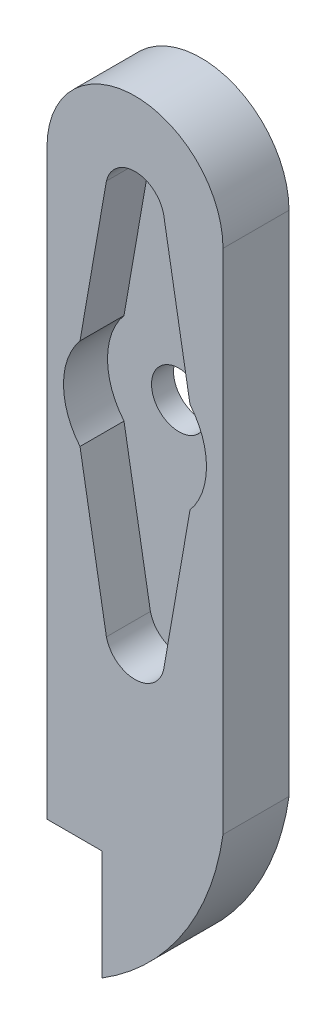
ISO-10303-21;
HEADER;
FILE_DESCRIPTION(('STEP AP214'),'2;1');
FILE_NAME('part.step','',(''),(''),'','','');
FILE_SCHEMA(('AUTOMOTIVE_DESIGN { 1 0 10303 214 1 1 1 1 }'));
ENDSEC;
DATA;
#1=APPLICATION_CONTEXT('core data for automotive mechanical design processes');
#2=APPLICATION_PROTOCOL_DEFINITION('international standard','automotive_design',2000,#1);
#3=PRODUCT_CONTEXT('',#1,'mechanical');
#4=PRODUCT('Part','Part','',(#3));
#5=PRODUCT_RELATED_PRODUCT_CATEGORY('part','',(#4));
#6=PRODUCT_DEFINITION_FORMATION('','',#4);
#7=PRODUCT_DEFINITION_CONTEXT('part definition',#1,'design');
#8=PRODUCT_DEFINITION('design','',#6,#7);
#9=PRODUCT_DEFINITION_SHAPE('','',#8);
#10=(LENGTH_UNIT() NAMED_UNIT(*) SI_UNIT(.MILLI.,.METRE.));
#11=(NAMED_UNIT(*) PLANE_ANGLE_UNIT() SI_UNIT($,.RADIAN.));
#12=(NAMED_UNIT(*) SI_UNIT($,.STERADIAN.) SOLID_ANGLE_UNIT());
#13=UNCERTAINTY_MEASURE_WITH_UNIT(LENGTH_MEASURE(1.E-05),#10,'distance_accuracy_value','');
#14=(GEOMETRIC_REPRESENTATION_CONTEXT(3) GLOBAL_UNCERTAINTY_ASSIGNED_CONTEXT((#13)) GLOBAL_UNIT_ASSIGNED_CONTEXT((#10,
#11,#12)) REPRESENTATION_CONTEXT('',''));
#15=CARTESIAN_POINT('',(0.,0.,0.));
#16=DIRECTION('',(0.,0.,1.));
#17=DIRECTION('',(1.,0.,0.));
#18=AXIS2_PLACEMENT_3D('',#15,#16,#17);
#19=CARTESIAN_POINT('',(-15.4438194612036,-24.8497426398111,6.));
#20=DIRECTION('',(0.,0.,-1.));
#21=DIRECTION('',(-1.,0.,0.));
#22=AXIS2_PLACEMENT_3D('',#19,#20,#21);
#23=CYLINDRICAL_SURFACE('',#22,23.6829372009655);
#24=CARTESIAN_POINT('',(-15.4438194612036,-24.8497426398111,0.));
#25=DIRECTION('',(0.,0.,1.));
#26=DIRECTION('',(1.,0.,0.));
#27=AXIS2_PLACEMENT_3D('',#24,#25,#26);
#28=CIRCLE('',#27,23.6829372009655);
#29=CARTESIAN_POINT('',(8.,-28.2066524591789,0.));
#30=VERTEX_POINT('',#29);
#31=CARTESIAN_POINT('',(-3.,-45.,0.));
#32=VERTEX_POINT('',#31);
#33=EDGE_CURVE('E225',#30,#32,#28,.F.);
#34=ORIENTED_EDGE('',*,*,#33,.F.);
#35=DIRECTION('',(0.,0.,-1.));
#36=VECTOR('',#35,1.);
#37=CARTESIAN_POINT('',(8.,-28.2066524591789,6.));
#38=LINE('',#37,#36);
#39=CARTESIAN_POINT('',(8.,-28.2066524591789,6.));
#40=VERTEX_POINT('',#39);
#41=EDGE_CURVE('E50',#40,#30,#38,.T.);
#42=ORIENTED_EDGE('',*,*,#41,.F.);
#43=CARTESIAN_POINT('',(-15.4438194612036,-24.8497426398111,6.));
#44=DIRECTION('',(0.,0.,1.));
#45=DIRECTION('',(1.,0.,0.));
#46=AXIS2_PLACEMENT_3D('',#43,#44,#45);
#47=CIRCLE('',#46,23.6829372009655);
#48=CARTESIAN_POINT('',(-3.,-45.,6.));
#49=VERTEX_POINT('',#48);
#50=EDGE_CURVE('E236',#40,#49,#47,.F.);
#51=ORIENTED_EDGE('',*,*,#50,.T.);
#52=DIRECTION('',(0.,0.,-1.));
#53=VECTOR('',#52,1.);
#54=CARTESIAN_POINT('',(-3.,-45.,6.));
#55=LINE('',#54,#53);
#56=EDGE_CURVE('E92',#49,#32,#55,.T.);
#57=ORIENTED_EDGE('',*,*,#56,.T.);
#58=EDGE_LOOP('',(#34,#42,#51,#57));
#59=FACE_BOUND('',#58,.T.);
#60=ADVANCED_FACE('F41',(#59),#23,.T.);
#61=CARTESIAN_POINT('',(8.,0.,6.));
#62=DIRECTION('',(-1.,0.,0.));
#63=DIRECTION('',(0.,0.,1.));
#64=AXIS2_PLACEMENT_3D('',#61,#62,#63);
#65=PLANE('',#64);
#66=DIRECTION('',(0.,1.,0.));
#67=VECTOR('',#66,1.);
#68=CARTESIAN_POINT('',(8.,0.,0.));
#69=LINE('',#68,#67);
#70=CARTESIAN_POINT('',(8.,17.9427517196533,0.));
#71=VERTEX_POINT('',#70);
#72=EDGE_CURVE('E221',#30,#71,#69,.T.);
#73=ORIENTED_EDGE('',*,*,#72,.T.);
#74=DIRECTION('',(0.,0.,-1.));
#75=VECTOR('',#74,1.);
#76=CARTESIAN_POINT('',(8.,17.9427517196533,6.));
#77=LINE('',#76,#75);
#78=CARTESIAN_POINT('',(8.,17.9427517196533,6.));
#79=VERTEX_POINT('',#78);
#80=EDGE_CURVE('E165',#79,#71,#77,.T.);
#81=ORIENTED_EDGE('',*,*,#80,.F.);
#82=DIRECTION('',(0.,1.,0.));
#83=VECTOR('',#82,1.);
#84=CARTESIAN_POINT('',(8.,0.,6.));
#85=LINE('',#84,#83);
#86=EDGE_CURVE('E233',#40,#79,#85,.T.);
#87=ORIENTED_EDGE('',*,*,#86,.F.);
#88=ORIENTED_EDGE('',*,*,#41,.T.);
#89=EDGE_LOOP('',(#73,#81,#87,#88));
#90=FACE_BOUND('',#89,.T.);
#91=ADVANCED_FACE('F316',(#90),#65,.F.);
#92=CARTESIAN_POINT('',(0.,17.9427517196533,6.));
#93=DIRECTION('',(0.,0.,-1.));
#94=DIRECTION('',(-1.,0.,0.));
#95=AXIS2_PLACEMENT_3D('',#92,#93,#94);
#96=CYLINDRICAL_SURFACE('',#95,8.);
#97=CARTESIAN_POINT('',(0.,17.9427517196533,0.));
#98=DIRECTION('',(0.,0.,1.));
#99=DIRECTION('',(1.,0.,0.));
#100=AXIS2_PLACEMENT_3D('',#97,#98,#99);
#101=CIRCLE('',#100,8.);
#102=CARTESIAN_POINT('',(-8.,17.9427517196533,0.));
#103=VERTEX_POINT('',#102);
#104=EDGE_CURVE('E217',#71,#103,#101,.T.);
#105=ORIENTED_EDGE('',*,*,#104,.T.);
#106=DIRECTION('',(0.,0.,-1.));
#107=VECTOR('',#106,1.);
#108=CARTESIAN_POINT('',(-8.,17.9427517196533,6.));
#109=LINE('',#108,#107);
#110=CARTESIAN_POINT('',(-8.,17.9427517196533,6.));
#111=VERTEX_POINT('',#110);
#112=EDGE_CURVE('E161',#111,#103,#109,.T.);
#113=ORIENTED_EDGE('',*,*,#112,.F.);
#114=CARTESIAN_POINT('',(0.,17.9427517196533,6.));
#115=DIRECTION('',(0.,0.,1.));
#116=DIRECTION('',(1.,0.,0.));
#117=AXIS2_PLACEMENT_3D('',#114,#115,#116);
#118=CIRCLE('',#117,8.);
#119=EDGE_CURVE('E152',#79,#111,#118,.T.);
#120=ORIENTED_EDGE('',*,*,#119,.F.);
#121=ORIENTED_EDGE('',*,*,#80,.T.);
#122=EDGE_LOOP('',(#105,#113,#120,#121));
#123=FACE_BOUND('',#122,.T.);
#124=ADVANCED_FACE('F321',(#123),#96,.T.);
#125=CARTESIAN_POINT('',(-8.,0.,6.));
#126=DIRECTION('',(1.,0.,0.));
#127=DIRECTION('',(0.,0.,-1.));
#128=AXIS2_PLACEMENT_3D('',#125,#126,#127);
#129=PLANE('',#128);
#130=DIRECTION('',(0.,-1.,0.));
#131=VECTOR('',#130,1.);
#132=CARTESIAN_POINT('',(-8.,0.,0.));
#133=LINE('',#132,#131);
#134=CARTESIAN_POINT('',(-8.,-35.,0.));
#135=VERTEX_POINT('',#134);
#136=EDGE_CURVE('E159',#103,#135,#133,.T.);
#137=ORIENTED_EDGE('',*,*,#136,.T.);
#138=DIRECTION('',(0.,0.,-1.));
#139=VECTOR('',#138,1.);
#140=CARTESIAN_POINT('',(-8.,-35.,6.));
#141=LINE('',#140,#139);
#142=CARTESIAN_POINT('',(-8.,-35.,6.));
#143=VERTEX_POINT('',#142);
#144=EDGE_CURVE('E142',#143,#135,#141,.T.);
#145=ORIENTED_EDGE('',*,*,#144,.F.);
#146=DIRECTION('',(0.,-1.,0.));
#147=VECTOR('',#146,1.);
#148=CARTESIAN_POINT('',(-8.,0.,6.));
#149=LINE('',#148,#147);
#150=EDGE_CURVE('E147',#111,#143,#149,.T.);
#151=ORIENTED_EDGE('',*,*,#150,.F.);
#152=ORIENTED_EDGE('',*,*,#112,.T.);
#153=EDGE_LOOP('',(#137,#145,#151,#152));
#154=FACE_BOUND('',#153,.T.);
#155=ADVANCED_FACE('F158',(#154),#129,.F.);
#156=CARTESIAN_POINT('',(0.,-35.,6.));
#157=DIRECTION('',(0.,1.,0.));
#158=DIRECTION('',(0.,0.,1.));
#159=AXIS2_PLACEMENT_3D('',#156,#157,#158);
#160=PLANE('',#159);
#161=DIRECTION('',(1.,0.,0.));
#162=VECTOR('',#161,1.);
#163=CARTESIAN_POINT('',(0.,-35.,0.));
#164=LINE('',#163,#162);
#165=CARTESIAN_POINT('',(-3.,-35.,0.));
#166=VERTEX_POINT('',#165);
#167=EDGE_CURVE('E212',#135,#166,#164,.T.);
#168=ORIENTED_EDGE('',*,*,#167,.T.);
#169=DIRECTION('',(0.,0.,-1.));
#170=VECTOR('',#169,1.);
#171=CARTESIAN_POINT('',(-3.,-35.,6.));
#172=LINE('',#171,#170);
#173=CARTESIAN_POINT('',(-3.,-35.,6.));
#174=VERTEX_POINT('',#173);
#175=EDGE_CURVE('E145',#174,#166,#172,.T.);
#176=ORIENTED_EDGE('',*,*,#175,.F.);
#177=DIRECTION('',(1.,0.,0.));
#178=VECTOR('',#177,1.);
#179=CARTESIAN_POINT('',(0.,-35.,6.));
#180=LINE('',#179,#178);
#181=EDGE_CURVE('E137',#143,#174,#180,.T.);
#182=ORIENTED_EDGE('',*,*,#181,.F.);
#183=ORIENTED_EDGE('',*,*,#144,.T.);
#184=EDGE_LOOP('',(#168,#176,#182,#183));
#185=FACE_BOUND('',#184,.T.);
#186=ADVANCED_FACE('F140',(#185),#160,.F.);
#187=CARTESIAN_POINT('',(0.,17.3284045022662,6.));
#188=DIRECTION('',(0.,0.,-1.));
#189=DIRECTION('',(-1.,0.,0.));
#190=AXIS2_PLACEMENT_3D('',#187,#188,#189);
#191=CYLINDRICAL_SURFACE('',#190,2.67159549773375);
#192=DIRECTION('',(0.,0.,-1.));
#193=VECTOR('',#192,1.);
#194=CARTESIAN_POINT('',(-2.6,17.9427517196533,6.));
#195=LINE('',#194,#193);
#196=CARTESIAN_POINT('',(-2.6,17.9427517196533,6.));
#197=VERTEX_POINT('',#196);
#198=CARTESIAN_POINT('',(-2.6,17.9427517196533,2.));
#199=VERTEX_POINT('',#198);
#200=EDGE_CURVE('E175',#197,#199,#195,.T.);
#201=ORIENTED_EDGE('',*,*,#200,.T.);
#202=CARTESIAN_POINT('',(0.,17.3284045022662,2.));
#203=DIRECTION('',(0.,0.,1.));
#204=DIRECTION('',(1.,0.,0.));
#205=AXIS2_PLACEMENT_3D('',#202,#203,#204);
#206=CIRCLE('',#205,2.67159549773375);
#207=CARTESIAN_POINT('',(2.6,17.9427517196533,2.));
#208=VERTEX_POINT('',#207);
#209=EDGE_CURVE('E57',#199,#208,#206,.F.);
#210=ORIENTED_EDGE('',*,*,#209,.T.);
#211=DIRECTION('',(0.,0.,-1.));
#212=VECTOR('',#211,1.);
#213=CARTESIAN_POINT('',(2.6,17.9427517196533,6.));
#214=LINE('',#213,#212);
#215=CARTESIAN_POINT('',(2.6,17.9427517196533,6.));
#216=VERTEX_POINT('',#215);
#217=EDGE_CURVE('E202',#216,#208,#214,.T.);
#218=ORIENTED_EDGE('',*,*,#217,.F.);
#219=CARTESIAN_POINT('',(0.,17.3284045022662,6.));
#220=DIRECTION('',(0.,0.,1.));
#221=DIRECTION('',(1.,0.,0.));
#222=AXIS2_PLACEMENT_3D('',#219,#220,#221);
#223=CIRCLE('',#222,2.67159549773375);
#224=EDGE_CURVE('E211',#197,#216,#223,.F.);
#225=ORIENTED_EDGE('',*,*,#224,.F.);
#226=EDGE_LOOP('',(#201,#210,#218,#225));
#227=FACE_BOUND('',#226,.T.);
#228=ADVANCED_FACE('F43',(#227),#191,.F.);
#229=CARTESIAN_POINT('',(5.55395819963136,0.96641337059102,6.));
#230=DIRECTION('',(0.985196551403809,0.171428571428571,0.));
#231=DIRECTION('',(-0.171428571428571,0.98519655140381,0.));
#232=AXIS2_PLACEMENT_3D('',#229,#230,#231);
#233=PLANE('',#232);
#234=ORIENTED_EDGE('',*,*,#217,.T.);
#235=DIRECTION('',(0.171428571428571,-0.98519655140381,0.));
#236=VECTOR('',#235,1.);
#237=CARTESIAN_POINT('',(5.55395819963136,0.96641337059102,2.));
#238=LINE('',#237,#236);
#239=CARTESIAN_POINT('',(4.99927103536296,4.15418934510465,2.));
#240=VERTEX_POINT('',#239);
#241=EDGE_CURVE('E268',#208,#240,#238,.T.);
#242=ORIENTED_EDGE('',*,*,#241,.T.);
#243=DIRECTION('',(0.,0.,-1.));
#244=VECTOR('',#243,1.);
#245=CARTESIAN_POINT('',(4.99927103536296,4.15418934510465,6.));
#246=LINE('',#245,#244);
#247=CARTESIAN_POINT('',(4.99927103536296,4.15418934510465,6.));
#248=VERTEX_POINT('',#247);
#249=EDGE_CURVE('E199',#248,#240,#246,.T.);
#250=ORIENTED_EDGE('',*,*,#249,.F.);
#251=DIRECTION('',(0.171428571428571,-0.98519655140381,0.));
#252=VECTOR('',#251,1.);
#253=CARTESIAN_POINT('',(5.55395819963136,0.96641337059102,6.));
#254=LINE('',#253,#252);
#255=EDGE_CURVE('E101',#216,#248,#254,.T.);
#256=ORIENTED_EDGE('',*,*,#255,.F.);
#257=EDGE_LOOP('',(#234,#242,#250,#256));
#258=FACE_BOUND('',#257,.T.);
#259=ADVANCED_FACE('F349',(#258),#233,.F.);
#260=CARTESIAN_POINT('',(0.,0.,6.));
#261=DIRECTION('',(0.,0.,-1.));
#262=DIRECTION('',(-1.,0.,0.));
#263=AXIS2_PLACEMENT_3D('',#260,#261,#262);
#264=CYLINDRICAL_SURFACE('',#263,6.5);
#265=CARTESIAN_POINT('',(0.,0.,2.));
#266=DIRECTION('',(0.,0.,1.));
#267=DIRECTION('',(1.,0.,0.));
#268=AXIS2_PLACEMENT_3D('',#265,#266,#267);
#269=CIRCLE('',#268,6.5);
#270=CARTESIAN_POINT('',(4.99927103536296,-4.15418934510465,2.));
#271=VERTEX_POINT('',#270);
#272=EDGE_CURVE('E271',#271,#240,#269,.T.);
#273=ORIENTED_EDGE('',*,*,#272,.F.);
#274=DIRECTION('',(0.,0.,-1.));
#275=VECTOR('',#274,1.);
#276=CARTESIAN_POINT('',(4.99927103536296,-4.15418934510465,6.));
#277=LINE('',#276,#275);
#278=CARTESIAN_POINT('',(4.99927103536296,-4.15418934510465,6.));
#279=VERTEX_POINT('',#278);
#280=EDGE_CURVE('E195',#279,#271,#277,.T.);
#281=ORIENTED_EDGE('',*,*,#280,.F.);
#282=CARTESIAN_POINT('',(0.,0.,6.));
#283=DIRECTION('',(0.,0.,1.));
#284=DIRECTION('',(1.,0.,0.));
#285=AXIS2_PLACEMENT_3D('',#282,#283,#284);
#286=CIRCLE('',#285,6.5);
#287=EDGE_CURVE('E258',#279,#248,#286,.T.);
#288=ORIENTED_EDGE('',*,*,#287,.T.);
#289=ORIENTED_EDGE('',*,*,#249,.T.);
#290=EDGE_LOOP('',(#273,#281,#288,#289));
#291=FACE_BOUND('',#290,.T.);
#292=ADVANCED_FACE('F346',(#291),#264,.F.);
#293=CARTESIAN_POINT('',(5.55395819963136,-0.96641337059102,6.));
#294=DIRECTION('',(-0.985196551403809,0.171428571428571,0.));
#295=DIRECTION('',(-0.171428571428571,-0.98519655140381,0.));
#296=AXIS2_PLACEMENT_3D('',#293,#294,#295);
#297=PLANE('',#296);
#298=DIRECTION('',(0.171428571428571,0.98519655140381,0.));
#299=VECTOR('',#298,1.);
#300=CARTESIAN_POINT('',(5.55395819963136,-0.96641337059102,2.));
#301=LINE('',#300,#299);
#302=CARTESIAN_POINT('',(2.6,-17.9427517196533,2.));
#303=VERTEX_POINT('',#302);
#304=EDGE_CURVE('E275',#303,#271,#301,.T.);
#305=ORIENTED_EDGE('',*,*,#304,.F.);
#306=DIRECTION('',(0.,0.,-1.));
#307=VECTOR('',#306,1.);
#308=CARTESIAN_POINT('',(2.6,-17.9427517196533,6.));
#309=LINE('',#308,#307);
#310=CARTESIAN_POINT('',(2.6,-17.9427517196533,6.));
#311=VERTEX_POINT('',#310);
#312=EDGE_CURVE('E191',#311,#303,#309,.T.);
#313=ORIENTED_EDGE('',*,*,#312,.F.);
#314=DIRECTION('',(0.171428571428571,0.98519655140381,0.));
#315=VECTOR('',#314,1.);
#316=CARTESIAN_POINT('',(5.55395819963136,-0.96641337059102,6.));
#317=LINE('',#316,#315);
#318=EDGE_CURVE('E254',#311,#279,#317,.T.);
#319=ORIENTED_EDGE('',*,*,#318,.T.);
#320=ORIENTED_EDGE('',*,*,#280,.T.);
#321=EDGE_LOOP('',(#305,#313,#319,#320));
#322=FACE_BOUND('',#321,.T.);
#323=ADVANCED_FACE('F342',(#322),#297,.T.);
#324=CARTESIAN_POINT('',(0.,-17.3284045022662,6.));
#325=DIRECTION('',(0.,0.,-1.));
#326=DIRECTION('',(-1.,0.,0.));
#327=AXIS2_PLACEMENT_3D('',#324,#325,#326);
#328=CYLINDRICAL_SURFACE('',#327,2.67159549773375);
#329=CARTESIAN_POINT('',(0.,-17.3284045022662,2.));
#330=DIRECTION('',(0.,0.,1.));
#331=DIRECTION('',(1.,0.,0.));
#332=AXIS2_PLACEMENT_3D('',#329,#330,#331);
#333=CIRCLE('',#332,2.67159549773375);
#334=CARTESIAN_POINT('',(-2.6,-17.9427517196533,2.));
#335=VERTEX_POINT('',#334);
#336=EDGE_CURVE('E279',#335,#303,#333,.T.);
#337=ORIENTED_EDGE('',*,*,#336,.F.);
#338=DIRECTION('',(0.,0.,-1.));
#339=VECTOR('',#338,1.);
#340=CARTESIAN_POINT('',(-2.6,-17.9427517196533,6.));
#341=LINE('',#340,#339);
#342=CARTESIAN_POINT('',(-2.6,-17.9427517196533,6.));
#343=VERTEX_POINT('',#342);
#344=EDGE_CURVE('E187',#343,#335,#341,.T.);
#345=ORIENTED_EDGE('',*,*,#344,.F.);
#346=CARTESIAN_POINT('',(0.,-17.3284045022662,6.));
#347=DIRECTION('',(0.,0.,1.));
#348=DIRECTION('',(1.,0.,0.));
#349=AXIS2_PLACEMENT_3D('',#346,#347,#348);
#350=CIRCLE('',#349,2.67159549773375);
#351=EDGE_CURVE('E250',#343,#311,#350,.T.);
#352=ORIENTED_EDGE('',*,*,#351,.T.);
#353=ORIENTED_EDGE('',*,*,#312,.T.);
#354=EDGE_LOOP('',(#337,#345,#352,#353));
#355=FACE_BOUND('',#354,.T.);
#356=ADVANCED_FACE('F338',(#355),#328,.F.);
#357=CARTESIAN_POINT('',(-5.55395819963136,-0.96641337059102,6.));
#358=DIRECTION('',(0.985196551403809,0.171428571428571,0.));
#359=DIRECTION('',(-0.171428571428571,0.98519655140381,0.));
#360=AXIS2_PLACEMENT_3D('',#357,#358,#359);
#361=PLANE('',#360);
#362=DIRECTION('',(0.171428571428571,-0.98519655140381,0.));
#363=VECTOR('',#362,1.);
#364=CARTESIAN_POINT('',(-5.55395819963136,-0.96641337059102,2.));
#365=LINE('',#364,#363);
#366=CARTESIAN_POINT('',(-4.99927103536296,-4.15418934510465,2.));
#367=VERTEX_POINT('',#366);
#368=EDGE_CURVE('E283',#367,#335,#365,.T.);
#369=ORIENTED_EDGE('',*,*,#368,.F.);
#370=DIRECTION('',(0.,0.,-1.));
#371=VECTOR('',#370,1.);
#372=CARTESIAN_POINT('',(-4.99927103536296,-4.15418934510465,6.));
#373=LINE('',#372,#371);
#374=CARTESIAN_POINT('',(-4.99927103536296,-4.15418934510465,6.));
#375=VERTEX_POINT('',#374);
#376=EDGE_CURVE('E183',#375,#367,#373,.T.);
#377=ORIENTED_EDGE('',*,*,#376,.F.);
#378=DIRECTION('',(0.171428571428571,-0.98519655140381,0.));
#379=VECTOR('',#378,1.);
#380=CARTESIAN_POINT('',(-5.55395819963136,-0.96641337059102,6.));
#381=LINE('',#380,#379);
#382=EDGE_CURVE('E246',#375,#343,#381,.T.);
#383=ORIENTED_EDGE('',*,*,#382,.T.);
#384=ORIENTED_EDGE('',*,*,#344,.T.);
#385=EDGE_LOOP('',(#369,#377,#383,#384));
#386=FACE_BOUND('',#385,.T.);
#387=ADVANCED_FACE('F334',(#386),#361,.T.);
#388=CARTESIAN_POINT('',(0.,0.,6.));
#389=DIRECTION('',(0.,0.,-1.));
#390=DIRECTION('',(-1.,0.,0.));
#391=AXIS2_PLACEMENT_3D('',#388,#389,#390);
#392=CYLINDRICAL_SURFACE('',#391,6.5);
#393=CARTESIAN_POINT('',(0.,0.,2.));
#394=DIRECTION('',(0.,0.,1.));
#395=DIRECTION('',(1.,0.,0.));
#396=AXIS2_PLACEMENT_3D('',#393,#394,#395);
#397=CIRCLE('',#396,6.5);
#398=CARTESIAN_POINT('',(-4.99927103536296,4.15418934510465,2.));
#399=VERTEX_POINT('',#398);
#400=EDGE_CURVE('E287',#399,#367,#397,.T.);
#401=ORIENTED_EDGE('',*,*,#400,.F.);
#402=DIRECTION('',(0.,0.,-1.));
#403=VECTOR('',#402,1.);
#404=CARTESIAN_POINT('',(-4.99927103536296,4.15418934510465,6.));
#405=LINE('',#404,#403);
#406=CARTESIAN_POINT('',(-4.99927103536296,4.15418934510465,6.));
#407=VERTEX_POINT('',#406);
#408=EDGE_CURVE('E179',#407,#399,#405,.T.);
#409=ORIENTED_EDGE('',*,*,#408,.F.);
#410=CARTESIAN_POINT('',(0.,0.,6.));
#411=DIRECTION('',(0.,0.,1.));
#412=DIRECTION('',(1.,0.,0.));
#413=AXIS2_PLACEMENT_3D('',#410,#411,#412);
#414=CIRCLE('',#413,6.5);
#415=EDGE_CURVE('E242',#407,#375,#414,.T.);
#416=ORIENTED_EDGE('',*,*,#415,.T.);
#417=ORIENTED_EDGE('',*,*,#376,.T.);
#418=EDGE_LOOP('',(#401,#409,#416,#417));
#419=FACE_BOUND('',#418,.T.);
#420=ADVANCED_FACE('F330',(#419),#392,.F.);
#421=CARTESIAN_POINT('',(-5.55395819963136,0.96641337059102,6.));
#422=DIRECTION('',(-0.985196551403809,0.171428571428571,0.));
#423=DIRECTION('',(-0.171428571428571,-0.98519655140381,0.));
#424=AXIS2_PLACEMENT_3D('',#421,#422,#423);
#425=PLANE('',#424);
#426=ORIENTED_EDGE('',*,*,#408,.T.);
#427=DIRECTION('',(0.171428571428571,0.98519655140381,0.));
#428=VECTOR('',#427,1.);
#429=CARTESIAN_POINT('',(-5.55395819963136,0.96641337059102,2.));
#430=LINE('',#429,#428);
#431=EDGE_CURVE('E11',#399,#199,#430,.T.);
#432=ORIENTED_EDGE('',*,*,#431,.T.);
#433=ORIENTED_EDGE('',*,*,#200,.F.);
#434=DIRECTION('',(0.171428571428571,0.98519655140381,0.));
#435=VECTOR('',#434,1.);
#436=CARTESIAN_POINT('',(-5.55395819963136,0.96641337059102,6.));
#437=LINE('',#436,#435);
#438=EDGE_CURVE('E239',#407,#197,#437,.T.);
#439=ORIENTED_EDGE('',*,*,#438,.F.);
#440=EDGE_LOOP('',(#426,#432,#433,#439));
#441=FACE_BOUND('',#440,.T.);
#442=ADVANCED_FACE('F326',(#441),#425,.F.);
#443=CARTESIAN_POINT('',(-3.,0.,6.));
#444=DIRECTION('',(1.,0.,0.));
#445=DIRECTION('',(0.,1.,0.));
#446=AXIS2_PLACEMENT_3D('',#443,#444,#445);
#447=PLANE('',#446);
#448=DIRECTION('',(0.,-1.,0.));
#449=VECTOR('',#448,1.);
#450=CARTESIAN_POINT('',(-3.,0.,0.));
#451=LINE('',#450,#449);
#452=EDGE_CURVE('E208',#166,#32,#451,.T.);
#453=ORIENTED_EDGE('',*,*,#452,.T.);
#454=ORIENTED_EDGE('',*,*,#56,.F.);
#455=DIRECTION('',(0.,-1.,0.));
#456=VECTOR('',#455,1.);
#457=CARTESIAN_POINT('',(-3.,0.,6.));
#458=LINE('',#457,#456);
#459=EDGE_CURVE('E65',#174,#49,#458,.T.);
#460=ORIENTED_EDGE('',*,*,#459,.F.);
#461=ORIENTED_EDGE('',*,*,#175,.T.);
#462=EDGE_LOOP('',(#453,#454,#460,#461));
#463=FACE_BOUND('',#462,.T.);
#464=ADVANCED_FACE('F329',(#463),#447,.F.);
#465=CARTESIAN_POINT('',(0.,0.,6.));
#466=DIRECTION('',(0.,0.,1.));
#467=DIRECTION('',(1.,0.,0.));
#468=AXIS2_PLACEMENT_3D('',#465,#466,#467);
#469=PLANE('',#468);
#470=ORIENTED_EDGE('',*,*,#224,.T.);
#471=ORIENTED_EDGE('',*,*,#255,.T.);
#472=ORIENTED_EDGE('',*,*,#287,.F.);
#473=ORIENTED_EDGE('',*,*,#318,.F.);
#474=ORIENTED_EDGE('',*,*,#351,.F.);
#475=ORIENTED_EDGE('',*,*,#382,.F.);
#476=ORIENTED_EDGE('',*,*,#415,.F.);
#477=ORIENTED_EDGE('',*,*,#438,.T.);
#478=EDGE_LOOP('',(#470,#471,#472,#473,#474,#475,#476,#477));
#479=FACE_BOUND('',#478,.T.);
#480=ORIENTED_EDGE('',*,*,#50,.F.);
#481=ORIENTED_EDGE('',*,*,#86,.T.);
#482=ORIENTED_EDGE('',*,*,#119,.T.);
#483=ORIENTED_EDGE('',*,*,#150,.T.);
#484=ORIENTED_EDGE('',*,*,#181,.T.);
#485=ORIENTED_EDGE('',*,*,#459,.T.);
#486=EDGE_LOOP('',(#480,#481,#482,#483,#484,#485));
#487=FACE_BOUND('',#486,.T.);
#488=ADVANCED_FACE('F150',(#479,#487),#469,.T.);
#489=CARTESIAN_POINT('',(0.,0.,0.));
#490=DIRECTION('',(0.,0.,1.));
#491=DIRECTION('',(1.,0.,0.));
#492=AXIS2_PLACEMENT_3D('',#489,#490,#491);
#493=PLANE('',#492);
#494=ORIENTED_EDGE('',*,*,#33,.T.);
#495=ORIENTED_EDGE('',*,*,#452,.F.);
#496=ORIENTED_EDGE('',*,*,#167,.F.);
#497=ORIENTED_EDGE('',*,*,#136,.F.);
#498=ORIENTED_EDGE('',*,*,#104,.F.);
#499=ORIENTED_EDGE('',*,*,#72,.F.);
#500=EDGE_LOOP('',(#494,#495,#496,#497,#498,#499));
#501=FACE_BOUND('',#500,.T.);
#502=CARTESIAN_POINT('',(0.,0.,0.));
#503=DIRECTION('',(0.,0.,1.));
#504=DIRECTION('',(1.,0.,0.));
#505=AXIS2_PLACEMENT_3D('',#502,#503,#504);
#506=CIRCLE('',#505,2.5);
#507=CARTESIAN_POINT('',(2.5,0.,0.));
#508=VERTEX_POINT('',#507);
#509=EDGE_CURVE('E292',#508,#508,#506,.T.);
#510=ORIENTED_EDGE('',*,*,#509,.T.);
#511=EDGE_LOOP('',(#510));
#512=FACE_BOUND('',#511,.T.);
#513=ADVANCED_FACE('F305',(#501,#512),#493,.F.);
#514=CARTESIAN_POINT('',(0.,0.,2.));
#515=DIRECTION('',(0.,0.,1.));
#516=DIRECTION('',(1.,0.,0.));
#517=AXIS2_PLACEMENT_3D('',#514,#515,#516);
#518=PLANE('',#517);
#519=CARTESIAN_POINT('',(0.,0.,2.));
#520=DIRECTION('',(0.,0.,1.));
#521=DIRECTION('',(1.,0.,0.));
#522=AXIS2_PLACEMENT_3D('',#519,#520,#521);
#523=CIRCLE('',#522,2.5);
#524=CARTESIAN_POINT('',(2.5,0.,2.));
#525=VERTEX_POINT('',#524);
#526=EDGE_CURVE('E291',#525,#525,#523,.T.);
#527=ORIENTED_EDGE('',*,*,#526,.F.);
#528=EDGE_LOOP('',(#527));
#529=FACE_BOUND('',#528,.T.);
#530=ORIENTED_EDGE('',*,*,#209,.F.);
#531=ORIENTED_EDGE('',*,*,#431,.F.);
#532=ORIENTED_EDGE('',*,*,#400,.T.);
#533=ORIENTED_EDGE('',*,*,#368,.T.);
#534=ORIENTED_EDGE('',*,*,#336,.T.);
#535=ORIENTED_EDGE('',*,*,#304,.T.);
#536=ORIENTED_EDGE('',*,*,#272,.T.);
#537=ORIENTED_EDGE('',*,*,#241,.F.);
#538=EDGE_LOOP('',(#530,#531,#532,#533,#534,#535,#536,#537));
#539=FACE_BOUND('',#538,.T.);
#540=ADVANCED_FACE('F303',(#529,#539),#518,.T.);
#541=CARTESIAN_POINT('',(0.,0.,2.));
#542=DIRECTION('',(0.,0.,-1.));
#543=DIRECTION('',(-1.,0.,0.));
#544=AXIS2_PLACEMENT_3D('',#541,#542,#543);
#545=CYLINDRICAL_SURFACE('',#544,2.5);
#546=ORIENTED_EDGE('',*,*,#526,.T.);
#547=EDGE_LOOP('',(#546));
#548=FACE_BOUND('',#547,.T.);
#549=ORIENTED_EDGE('',*,*,#509,.F.);
#550=EDGE_LOOP('',(#549));
#551=FACE_BOUND('',#550,.T.);
#552=ADVANCED_FACE('F300',(#548,#551),#545,.F.);
#553=CLOSED_SHELL('',(#60,#91,#124,#155,#186,#228,#259,#292,#323,#356,#387,#420,#442,#464,#488,
#513,#540,#552));
#554=MANIFOLD_SOLID_BREP('B2',#553);
#555=ADVANCED_BREP_SHAPE_REPRESENTATION('',(#18,#554),#14);
#556=SHAPE_DEFINITION_REPRESENTATION(#9,#555);
ENDSEC;
END-ISO-10303-21;
